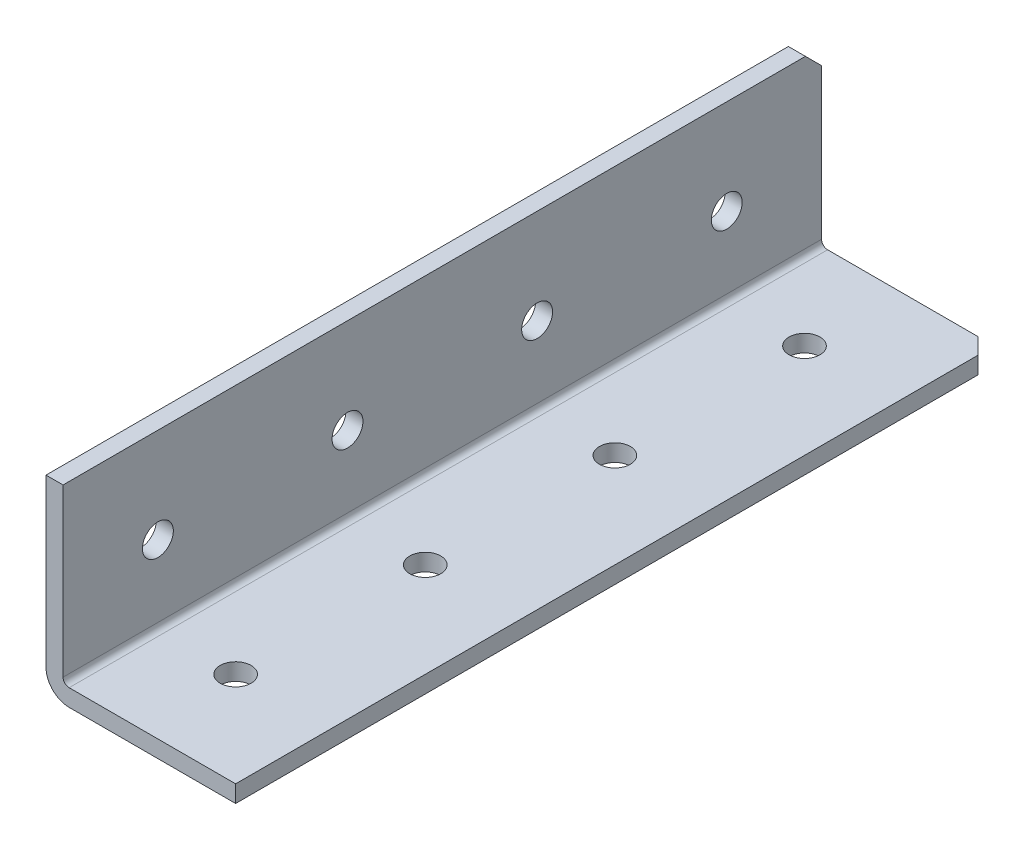
ISO-10303-21;
HEADER;
FILE_DESCRIPTION(('STEP AP214'),'2;1');
FILE_NAME('part.step','',(''),(''),'','','');
FILE_SCHEMA(('AUTOMOTIVE_DESIGN { 1 0 10303 214 1 1 1 1 }'));
ENDSEC;
DATA;
#1=APPLICATION_CONTEXT('core data for automotive mechanical design processes');
#2=APPLICATION_PROTOCOL_DEFINITION('international standard','automotive_design',2000,#1);
#3=PRODUCT_CONTEXT('',#1,'mechanical');
#4=PRODUCT('Part','Part','',(#3));
#5=PRODUCT_RELATED_PRODUCT_CATEGORY('part','',(#4));
#6=PRODUCT_DEFINITION_FORMATION('','',#4);
#7=PRODUCT_DEFINITION_CONTEXT('part definition',#1,'design');
#8=PRODUCT_DEFINITION('design','',#6,#7);
#9=PRODUCT_DEFINITION_SHAPE('','',#8);
#10=(LENGTH_UNIT() NAMED_UNIT(*) SI_UNIT(.MILLI.,.METRE.));
#11=(NAMED_UNIT(*) PLANE_ANGLE_UNIT() SI_UNIT($,.RADIAN.));
#12=(NAMED_UNIT(*) SI_UNIT($,.STERADIAN.) SOLID_ANGLE_UNIT());
#13=UNCERTAINTY_MEASURE_WITH_UNIT(LENGTH_MEASURE(1.E-05),#10,'distance_accuracy_value','');
#14=(GEOMETRIC_REPRESENTATION_CONTEXT(3) GLOBAL_UNCERTAINTY_ASSIGNED_CONTEXT((#13)) GLOBAL_UNIT_ASSIGNED_CONTEXT((#10,
#11,#12)) REPRESENTATION_CONTEXT('',''));
#15=CARTESIAN_POINT('',(0.,0.,0.));
#16=DIRECTION('',(0.,0.,1.));
#17=DIRECTION('',(1.,0.,0.));
#18=AXIS2_PLACEMENT_3D('',#15,#16,#17);
#19=CARTESIAN_POINT('',(25.4,0.,-749.3));
#20=DIRECTION('',(0.,-1.,0.));
#21=DIRECTION('',(0.,0.,-1.));
#22=AXIS2_PLACEMENT_3D('',#19,#20,#21);
#23=PLANE('',#22);
#24=DIRECTION('',(1.,0.,0.));
#25=VECTOR('',#24,1.);
#26=CARTESIAN_POINT('',(25.4,0.,-647.7));
#27=LINE('',#26,#25);
#28=CARTESIAN_POINT('',(3.0988,0.,-647.7));
#29=VERTEX_POINT('',#28);
#30=CARTESIAN_POINT('',(25.4,0.,-647.7));
#31=VERTEX_POINT('',#30);
#32=EDGE_CURVE('E110',#29,#31,#27,.T.);
#33=ORIENTED_EDGE('',*,*,#32,.F.);
#34=DIRECTION('',(0.,0.,1.));
#35=VECTOR('',#34,1.);
#36=CARTESIAN_POINT('',(3.0988,0.,-749.3));
#37=LINE('',#36,#35);
#38=CARTESIAN_POINT('',(3.0988,0.,-749.3));
#39=VERTEX_POINT('',#38);
#40=EDGE_CURVE('E56',#29,#39,#37,.F.);
#41=ORIENTED_EDGE('',*,*,#40,.T.);
#42=DIRECTION('',(-1.,0.,0.));
#43=VECTOR('',#42,1.);
#44=CARTESIAN_POINT('',(25.4,0.,-749.3));
#45=LINE('',#44,#43);
#46=CARTESIAN_POINT('',(23.2409999999998,0.,-749.3));
#47=VERTEX_POINT('',#46);
#48=EDGE_CURVE('E155',#47,#39,#45,.T.);
#49=ORIENTED_EDGE('',*,*,#48,.F.);
#50=DIRECTION('',(0.707106781186584,0.,0.707106781186511));
#51=VECTOR('',#50,1.);
#52=CARTESIAN_POINT('',(24.3205,0.,-748.2205));
#53=LINE('',#52,#51);
#54=CARTESIAN_POINT('',(25.4,0.,-747.141));
#55=VERTEX_POINT('',#54);
#56=EDGE_CURVE('E147',#47,#55,#53,.T.);
#57=ORIENTED_EDGE('',*,*,#56,.T.);
#58=DIRECTION('',(0.,0.,1.));
#59=VECTOR('',#58,1.);
#60=CARTESIAN_POINT('',(25.4,0.,-749.3));
#61=LINE('',#60,#59);
#62=EDGE_CURVE('E118',#55,#31,#61,.T.);
#63=ORIENTED_EDGE('',*,*,#62,.T.);
#64=EDGE_LOOP('',(#33,#41,#49,#57,#63));
#65=FACE_BOUND('',#64,.T.);
#66=CARTESIAN_POINT('',(12.7,0.,-736.6));
#67=DIRECTION('',(0.,-1.,0.));
#68=DIRECTION('',(0.,0.,-1.));
#69=AXIS2_PLACEMENT_3D('',#66,#67,#68);
#70=CIRCLE('',#69,2.07009999999995);
#71=CARTESIAN_POINT('',(12.7,0.,-738.6701));
#72=VERTEX_POINT('',#71);
#73=EDGE_CURVE('E160',#72,#72,#70,.T.);
#74=ORIENTED_EDGE('',*,*,#73,.F.);
#75=EDGE_LOOP('',(#74));
#76=FACE_BOUND('',#75,.T.);
#77=CARTESIAN_POINT('',(12.7,0.,-711.2));
#78=DIRECTION('',(0.,-1.,0.));
#79=DIRECTION('',(0.,0.,-1.));
#80=AXIS2_PLACEMENT_3D('',#77,#78,#79);
#81=CIRCLE('',#80,2.07009999999995);
#82=CARTESIAN_POINT('',(12.7,0.,-713.2701));
#83=VERTEX_POINT('',#82);
#84=EDGE_CURVE('E159',#83,#83,#81,.T.);
#85=ORIENTED_EDGE('',*,*,#84,.F.);
#86=EDGE_LOOP('',(#85));
#87=FACE_BOUND('',#86,.T.);
#88=CARTESIAN_POINT('',(12.7,0.,-685.8));
#89=DIRECTION('',(0.,-1.,0.));
#90=DIRECTION('',(0.,0.,-1.));
#91=AXIS2_PLACEMENT_3D('',#88,#89,#90);
#92=CIRCLE('',#91,2.07009999999995);
#93=CARTESIAN_POINT('',(12.7,0.,-687.8701));
#94=VERTEX_POINT('',#93);
#95=EDGE_CURVE('E186',#94,#94,#92,.T.);
#96=ORIENTED_EDGE('',*,*,#95,.F.);
#97=EDGE_LOOP('',(#96));
#98=FACE_BOUND('',#97,.T.);
#99=CARTESIAN_POINT('',(12.7,0.,-660.4));
#100=DIRECTION('',(0.,-1.,0.));
#101=DIRECTION('',(0.,0.,-1.));
#102=AXIS2_PLACEMENT_3D('',#99,#100,#101);
#103=CIRCLE('',#102,2.07009999999995);
#104=CARTESIAN_POINT('',(12.7,0.,-662.4701));
#105=VERTEX_POINT('',#104);
#106=EDGE_CURVE('E180',#105,#105,#103,.T.);
#107=ORIENTED_EDGE('',*,*,#106,.F.);
#108=EDGE_LOOP('',(#107));
#109=FACE_BOUND('',#108,.T.);
#110=ADVANCED_FACE('F34',(#65,#76,#87,#98,#109),#23,.T.);
#111=CARTESIAN_POINT('',(25.4,25.4,-749.3));
#112=DIRECTION('',(0.,0.,-1.));
#113=DIRECTION('',(-1.,0.,0.));
#114=AXIS2_PLACEMENT_3D('',#111,#112,#113);
#115=PLANE('',#114);
#116=ORIENTED_EDGE('',*,*,#48,.T.);
#117=CARTESIAN_POINT('',(3.0988,3.0988,-749.3));
#118=DIRECTION('',(0.,0.,-1.));
#119=DIRECTION('',(-1.,0.,0.));
#120=AXIS2_PLACEMENT_3D('',#117,#118,#119);
#121=CIRCLE('',#120,3.0988);
#122=CARTESIAN_POINT('',(0.,3.0988,-749.3));
#123=VERTEX_POINT('',#122);
#124=EDGE_CURVE('E42',#39,#123,#121,.T.);
#125=ORIENTED_EDGE('',*,*,#124,.T.);
#126=DIRECTION('',(0.,-1.,0.));
#127=VECTOR('',#126,1.);
#128=CARTESIAN_POINT('',(0.,25.4,-749.3));
#129=LINE('',#128,#127);
#130=CARTESIAN_POINT('',(0.,23.241,-749.3));
#131=VERTEX_POINT('',#130);
#132=EDGE_CURVE('E162',#131,#123,#129,.T.);
#133=ORIENTED_EDGE('',*,*,#132,.F.);
#134=DIRECTION('',(1.,0.,0.));
#135=VECTOR('',#134,1.);
#136=CARTESIAN_POINT('',(25.4,23.241,-749.3));
#137=LINE('',#136,#135);
#138=CARTESIAN_POINT('',(2.286,23.241,-749.3));
#139=VERTEX_POINT('',#138);
#140=EDGE_CURVE('E152',#131,#139,#137,.T.);
#141=ORIENTED_EDGE('',*,*,#140,.T.);
#142=DIRECTION('',(0.,1.,0.));
#143=VECTOR('',#142,1.);
#144=CARTESIAN_POINT('',(2.286,2.286,-749.3));
#145=LINE('',#144,#143);
#146=CARTESIAN_POINT('',(2.286,3.0988,-749.3));
#147=VERTEX_POINT('',#146);
#148=EDGE_CURVE('E171',#147,#139,#145,.T.);
#149=ORIENTED_EDGE('',*,*,#148,.F.);
#150=CARTESIAN_POINT('',(3.0988,3.0988,-749.3));
#151=DIRECTION('',(0.,0.,-1.));
#152=DIRECTION('',(-1.,0.,0.));
#153=AXIS2_PLACEMENT_3D('',#150,#151,#152);
#154=CIRCLE('',#153,0.8128);
#155=CARTESIAN_POINT('',(3.0988,2.286,-749.3));
#156=VERTEX_POINT('',#155);
#157=EDGE_CURVE('E125',#147,#156,#154,.F.);
#158=ORIENTED_EDGE('',*,*,#157,.T.);
#159=DIRECTION('',(-1.,0.,0.));
#160=VECTOR('',#159,1.);
#161=CARTESIAN_POINT('',(25.4,2.286,-749.3));
#162=LINE('',#161,#160);
#163=CARTESIAN_POINT('',(23.2409999999998,2.286,-749.3));
#164=VERTEX_POINT('',#163);
#165=EDGE_CURVE('E174',#164,#156,#162,.T.);
#166=ORIENTED_EDGE('',*,*,#165,.F.);
#167=DIRECTION('',(0.,-1.,0.));
#168=VECTOR('',#167,1.);
#169=CARTESIAN_POINT('',(23.2409999999998,0.,-749.3));
#170=LINE('',#169,#168);
#171=EDGE_CURVE('E149',#164,#47,#170,.T.);
#172=ORIENTED_EDGE('',*,*,#171,.T.);
#173=EDGE_LOOP('',(#116,#125,#133,#141,#149,#158,#166,#172));
#174=FACE_BOUND('',#173,.T.);
#175=ADVANCED_FACE('F247',(#174),#115,.T.);
#176=CARTESIAN_POINT('',(25.4,25.4,749.3));
#177=DIRECTION('',(0.,1.,0.));
#178=DIRECTION('',(0.,0.,1.));
#179=AXIS2_PLACEMENT_3D('',#176,#177,#178);
#180=PLANE('',#179);
#181=DIRECTION('',(-1.,0.,0.));
#182=VECTOR('',#181,1.);
#183=CARTESIAN_POINT('',(25.4,25.4,-647.7));
#184=LINE('',#183,#182);
#185=CARTESIAN_POINT('',(2.286,25.4,-647.7));
#186=VERTEX_POINT('',#185);
#187=CARTESIAN_POINT('',(0.,25.4000000000002,-647.7));
#188=VERTEX_POINT('',#187);
#189=EDGE_CURVE('E120',#186,#188,#184,.T.);
#190=ORIENTED_EDGE('',*,*,#189,.F.);
#191=DIRECTION('',(0.,0.,-1.));
#192=VECTOR('',#191,1.);
#193=CARTESIAN_POINT('',(2.286,25.4,749.3));
#194=LINE('',#193,#192);
#195=CARTESIAN_POINT('',(2.286,25.4,-747.141));
#196=VERTEX_POINT('',#195);
#197=EDGE_CURVE('E167',#186,#196,#194,.T.);
#198=ORIENTED_EDGE('',*,*,#197,.T.);
#199=DIRECTION('',(-1.,0.,0.));
#200=VECTOR('',#199,1.);
#201=CARTESIAN_POINT('',(25.4,25.4,-747.141));
#202=LINE('',#201,#200);
#203=CARTESIAN_POINT('',(0.,25.4000000000002,-747.140999999999));
#204=VERTEX_POINT('',#203);
#205=EDGE_CURVE('E139',#196,#204,#202,.T.);
#206=ORIENTED_EDGE('',*,*,#205,.T.);
#207=DIRECTION('',(0.,0.,-1.));
#208=VECTOR('',#207,1.);
#209=CARTESIAN_POINT('',(0.,25.4,749.3));
#210=LINE('',#209,#208);
#211=EDGE_CURVE('E165',#188,#204,#210,.T.);
#212=ORIENTED_EDGE('',*,*,#211,.F.);
#213=EDGE_LOOP('',(#190,#198,#206,#212));
#214=FACE_BOUND('',#213,.T.);
#215=ADVANCED_FACE('F239',(#214),#180,.T.);
#216=CARTESIAN_POINT('',(25.4,0.,0.));
#217=DIRECTION('',(-1.,0.,0.));
#218=DIRECTION('',(0.,0.,1.));
#219=AXIS2_PLACEMENT_3D('',#216,#217,#218);
#220=PLANE('',#219);
#221=DIRECTION('',(0.,0.,-1.));
#222=VECTOR('',#221,1.);
#223=CARTESIAN_POINT('',(25.4,2.286,749.3));
#224=LINE('',#223,#222);
#225=CARTESIAN_POINT('',(25.4,2.286,-647.7));
#226=VERTEX_POINT('',#225);
#227=CARTESIAN_POINT('',(25.4000000000001,2.286,-747.141));
#228=VERTEX_POINT('',#227);
#229=EDGE_CURVE('E169',#226,#228,#224,.T.);
#230=ORIENTED_EDGE('',*,*,#229,.F.);
#231=DIRECTION('',(0.,-1.,0.));
#232=VECTOR('',#231,1.);
#233=CARTESIAN_POINT('',(25.4,0.,-647.7));
#234=LINE('',#233,#232);
#235=EDGE_CURVE('E226',#226,#31,#234,.T.);
#236=ORIENTED_EDGE('',*,*,#235,.T.);
#237=ORIENTED_EDGE('',*,*,#62,.F.);
#238=DIRECTION('',(0.,1.,0.));
#239=VECTOR('',#238,1.);
#240=CARTESIAN_POINT('',(25.4,2.286,-747.141));
#241=LINE('',#240,#239);
#242=EDGE_CURVE('E144',#55,#228,#241,.T.);
#243=ORIENTED_EDGE('',*,*,#242,.T.);
#244=EDGE_LOOP('',(#230,#236,#237,#243));
#245=FACE_BOUND('',#244,.T.);
#246=ADVANCED_FACE('F255',(#245),#220,.F.);
#247=CARTESIAN_POINT('',(0.,0.,0.));
#248=DIRECTION('',(-1.,0.,0.));
#249=DIRECTION('',(0.,0.,1.));
#250=AXIS2_PLACEMENT_3D('',#247,#248,#249);
#251=PLANE('',#250);
#252=DIRECTION('',(0.,-1.,0.));
#253=VECTOR('',#252,1.);
#254=CARTESIAN_POINT('',(0.,0.,-647.7));
#255=LINE('',#254,#253);
#256=CARTESIAN_POINT('',(0.,3.0988,-647.7));
#257=VERTEX_POINT('',#256);
#258=EDGE_CURVE('E48',#188,#257,#255,.T.);
#259=ORIENTED_EDGE('',*,*,#258,.F.);
#260=ORIENTED_EDGE('',*,*,#211,.T.);
#261=DIRECTION('',(0.,0.707106781186511,0.707106781186584));
#262=VECTOR('',#261,1.);
#263=CARTESIAN_POINT('',(0.,386.270500000001,-386.270499999961));
#264=LINE('',#263,#262);
#265=EDGE_CURVE('E137',#204,#131,#264,.F.);
#266=ORIENTED_EDGE('',*,*,#265,.T.);
#267=ORIENTED_EDGE('',*,*,#132,.T.);
#268=DIRECTION('',(0.,0.,1.));
#269=VECTOR('',#268,1.);
#270=CARTESIAN_POINT('',(0.,3.0988,0.));
#271=LINE('',#270,#269);
#272=EDGE_CURVE('E123',#123,#257,#271,.T.);
#273=ORIENTED_EDGE('',*,*,#272,.T.);
#274=EDGE_LOOP('',(#259,#260,#266,#267,#273));
#275=FACE_BOUND('',#274,.T.);
#276=CARTESIAN_POINT('',(0.,12.7,-660.4));
#277=DIRECTION('',(-1.,0.,0.));
#278=DIRECTION('',(0.,0.,1.));
#279=AXIS2_PLACEMENT_3D('',#276,#277,#278);
#280=CIRCLE('',#279,2.07009999999995);
#281=CARTESIAN_POINT('',(0.,12.7,-658.3299));
#282=VERTEX_POINT('',#281);
#283=EDGE_CURVE('E217',#282,#282,#280,.T.);
#284=ORIENTED_EDGE('',*,*,#283,.F.);
#285=EDGE_LOOP('',(#284));
#286=FACE_BOUND('',#285,.T.);
#287=CARTESIAN_POINT('',(0.,12.7,-685.8));
#288=DIRECTION('',(-1.,0.,0.));
#289=DIRECTION('',(0.,0.,1.));
#290=AXIS2_PLACEMENT_3D('',#287,#288,#289);
#291=CIRCLE('',#290,2.07009999999995);
#292=CARTESIAN_POINT('',(0.,12.7,-683.7299));
#293=VERTEX_POINT('',#292);
#294=EDGE_CURVE('E211',#293,#293,#291,.T.);
#295=ORIENTED_EDGE('',*,*,#294,.F.);
#296=EDGE_LOOP('',(#295));
#297=FACE_BOUND('',#296,.T.);
#298=CARTESIAN_POINT('',(0.,12.7,-711.2));
#299=DIRECTION('',(-1.,0.,0.));
#300=DIRECTION('',(0.,0.,1.));
#301=AXIS2_PLACEMENT_3D('',#298,#299,#300);
#302=CIRCLE('',#301,2.07009999999995);
#303=CARTESIAN_POINT('',(0.,12.7,-709.1299));
#304=VERTEX_POINT('',#303);
#305=EDGE_CURVE('E205',#304,#304,#302,.T.);
#306=ORIENTED_EDGE('',*,*,#305,.F.);
#307=EDGE_LOOP('',(#306));
#308=FACE_BOUND('',#307,.T.);
#309=CARTESIAN_POINT('',(0.,12.7,-736.6));
#310=DIRECTION('',(-1.,0.,0.));
#311=DIRECTION('',(0.,0.,1.));
#312=AXIS2_PLACEMENT_3D('',#309,#310,#311);
#313=CIRCLE('',#312,2.07009999999995);
#314=CARTESIAN_POINT('',(0.,12.7,-734.5299));
#315=VERTEX_POINT('',#314);
#316=EDGE_CURVE('E199',#315,#315,#313,.T.);
#317=ORIENTED_EDGE('',*,*,#316,.F.);
#318=EDGE_LOOP('',(#317));
#319=FACE_BOUND('',#318,.T.);
#320=ADVANCED_FACE('F236',(#275,#286,#297,#308,#319),#251,.T.);
#321=CARTESIAN_POINT('',(2.286,2.286,749.3));
#322=DIRECTION('',(-1.,0.,0.));
#323=DIRECTION('',(0.,0.,1.));
#324=AXIS2_PLACEMENT_3D('',#321,#322,#323);
#325=PLANE('',#324);
#326=CARTESIAN_POINT('',(2.286,12.7,-660.4));
#327=DIRECTION('',(-1.,0.,0.));
#328=DIRECTION('',(0.,0.,1.));
#329=AXIS2_PLACEMENT_3D('',#326,#327,#328);
#330=CIRCLE('',#329,2.07009999999995);
#331=CARTESIAN_POINT('',(2.286,12.7,-658.3299));
#332=VERTEX_POINT('',#331);
#333=EDGE_CURVE('E214',#332,#332,#330,.T.);
#334=ORIENTED_EDGE('',*,*,#333,.T.);
#335=EDGE_LOOP('',(#334));
#336=FACE_BOUND('',#335,.T.);
#337=CARTESIAN_POINT('',(2.286,12.7,-685.8));
#338=DIRECTION('',(-1.,0.,0.));
#339=DIRECTION('',(0.,0.,1.));
#340=AXIS2_PLACEMENT_3D('',#337,#338,#339);
#341=CIRCLE('',#340,2.07009999999995);
#342=CARTESIAN_POINT('',(2.286,12.7,-683.7299));
#343=VERTEX_POINT('',#342);
#344=EDGE_CURVE('E208',#343,#343,#341,.T.);
#345=ORIENTED_EDGE('',*,*,#344,.T.);
#346=EDGE_LOOP('',(#345));
#347=FACE_BOUND('',#346,.T.);
#348=CARTESIAN_POINT('',(2.286,12.7,-711.2));
#349=DIRECTION('',(-1.,0.,0.));
#350=DIRECTION('',(0.,0.,1.));
#351=AXIS2_PLACEMENT_3D('',#348,#349,#350);
#352=CIRCLE('',#351,2.07009999999995);
#353=CARTESIAN_POINT('',(2.286,12.7,-709.1299));
#354=VERTEX_POINT('',#353);
#355=EDGE_CURVE('E202',#354,#354,#352,.T.);
#356=ORIENTED_EDGE('',*,*,#355,.T.);
#357=EDGE_LOOP('',(#356));
#358=FACE_BOUND('',#357,.T.);
#359=CARTESIAN_POINT('',(2.286,12.7,-736.6));
#360=DIRECTION('',(-1.,0.,0.));
#361=DIRECTION('',(0.,0.,1.));
#362=AXIS2_PLACEMENT_3D('',#359,#360,#361);
#363=CIRCLE('',#362,2.07009999999995);
#364=CARTESIAN_POINT('',(2.286,12.7,-734.5299));
#365=VERTEX_POINT('',#364);
#366=EDGE_CURVE('E196',#365,#365,#363,.T.);
#367=ORIENTED_EDGE('',*,*,#366,.T.);
#368=EDGE_LOOP('',(#367));
#369=FACE_BOUND('',#368,.T.);
#370=ORIENTED_EDGE('',*,*,#197,.F.);
#371=DIRECTION('',(0.,-1.,0.));
#372=VECTOR('',#371,1.);
#373=CARTESIAN_POINT('',(2.286,2.286,-647.7));
#374=LINE('',#373,#372);
#375=CARTESIAN_POINT('',(2.286,3.0988,-647.7));
#376=VERTEX_POINT('',#375);
#377=EDGE_CURVE('E119',#186,#376,#374,.T.);
#378=ORIENTED_EDGE('',*,*,#377,.T.);
#379=DIRECTION('',(0.,0.,-1.));
#380=VECTOR('',#379,1.);
#381=CARTESIAN_POINT('',(2.286,3.0988,-749.3));
#382=LINE('',#381,#380);
#383=EDGE_CURVE('E132',#376,#147,#382,.T.);
#384=ORIENTED_EDGE('',*,*,#383,.T.);
#385=ORIENTED_EDGE('',*,*,#148,.T.);
#386=DIRECTION('',(0.,-0.707106781186511,-0.707106781186584));
#387=VECTOR('',#386,1.);
#388=CARTESIAN_POINT('',(2.286,25.4,-747.141));
#389=LINE('',#388,#387);
#390=EDGE_CURVE('E134',#139,#196,#389,.F.);
#391=ORIENTED_EDGE('',*,*,#390,.T.);
#392=EDGE_LOOP('',(#370,#378,#384,#385,#391));
#393=FACE_BOUND('',#392,.T.);
#394=ADVANCED_FACE('F266',(#336,#347,#358,#369,#393),#325,.F.);
#395=CARTESIAN_POINT('',(25.4,2.286,749.3));
#396=DIRECTION('',(0.,-1.,0.));
#397=DIRECTION('',(0.,0.,-1.));
#398=AXIS2_PLACEMENT_3D('',#395,#396,#397);
#399=PLANE('',#398);
#400=CARTESIAN_POINT('',(12.7,2.286,-736.6));
#401=DIRECTION('',(0.,-1.,0.));
#402=DIRECTION('',(0.,0.,-1.));
#403=AXIS2_PLACEMENT_3D('',#400,#401,#402);
#404=CIRCLE('',#403,2.07009999999995);
#405=CARTESIAN_POINT('',(12.7,2.286,-738.6701));
#406=VERTEX_POINT('',#405);
#407=EDGE_CURVE('E156',#406,#406,#404,.T.);
#408=ORIENTED_EDGE('',*,*,#407,.T.);
#409=EDGE_LOOP('',(#408));
#410=FACE_BOUND('',#409,.T.);
#411=CARTESIAN_POINT('',(12.7,2.286,-711.2));
#412=DIRECTION('',(0.,-1.,0.));
#413=DIRECTION('',(0.,0.,-1.));
#414=AXIS2_PLACEMENT_3D('',#411,#412,#413);
#415=CIRCLE('',#414,2.07009999999995);
#416=CARTESIAN_POINT('',(12.7,2.286,-713.2701));
#417=VERTEX_POINT('',#416);
#418=EDGE_CURVE('E189',#417,#417,#415,.T.);
#419=ORIENTED_EDGE('',*,*,#418,.T.);
#420=EDGE_LOOP('',(#419));
#421=FACE_BOUND('',#420,.T.);
#422=CARTESIAN_POINT('',(12.7,2.286,-685.8));
#423=DIRECTION('',(0.,-1.,0.));
#424=DIRECTION('',(0.,0.,-1.));
#425=AXIS2_PLACEMENT_3D('',#422,#423,#424);
#426=CIRCLE('',#425,2.07009999999995);
#427=CARTESIAN_POINT('',(12.7,2.286,-687.8701));
#428=VERTEX_POINT('',#427);
#429=EDGE_CURVE('E183',#428,#428,#426,.T.);
#430=ORIENTED_EDGE('',*,*,#429,.T.);
#431=EDGE_LOOP('',(#430));
#432=FACE_BOUND('',#431,.T.);
#433=CARTESIAN_POINT('',(12.7,2.286,-660.4));
#434=DIRECTION('',(0.,-1.,0.));
#435=DIRECTION('',(0.,0.,-1.));
#436=AXIS2_PLACEMENT_3D('',#433,#434,#435);
#437=CIRCLE('',#436,2.07009999999995);
#438=CARTESIAN_POINT('',(12.7,2.286,-662.4701));
#439=VERTEX_POINT('',#438);
#440=EDGE_CURVE('E177',#439,#439,#437,.T.);
#441=ORIENTED_EDGE('',*,*,#440,.T.);
#442=EDGE_LOOP('',(#441));
#443=FACE_BOUND('',#442,.T.);
#444=DIRECTION('',(0.,0.,-1.));
#445=VECTOR('',#444,1.);
#446=CARTESIAN_POINT('',(3.0988,2.286,749.3));
#447=LINE('',#446,#445);
#448=CARTESIAN_POINT('',(3.0988,2.286,-647.7));
#449=VERTEX_POINT('',#448);
#450=EDGE_CURVE('E129',#156,#449,#447,.F.);
#451=ORIENTED_EDGE('',*,*,#450,.T.);
#452=DIRECTION('',(1.,0.,0.));
#453=VECTOR('',#452,1.);
#454=CARTESIAN_POINT('',(25.4,2.286,-647.7));
#455=LINE('',#454,#453);
#456=EDGE_CURVE('E220',#449,#226,#455,.T.);
#457=ORIENTED_EDGE('',*,*,#456,.T.);
#458=ORIENTED_EDGE('',*,*,#229,.T.);
#459=DIRECTION('',(-0.707106781186584,0.,-0.707106781186511));
#460=VECTOR('',#459,1.);
#461=CARTESIAN_POINT('',(23.2409999999998,2.286,-749.3));
#462=LINE('',#461,#460);
#463=EDGE_CURVE('E142',#228,#164,#462,.T.);
#464=ORIENTED_EDGE('',*,*,#463,.T.);
#465=ORIENTED_EDGE('',*,*,#165,.T.);
#466=EDGE_LOOP('',(#451,#457,#458,#464,#465));
#467=FACE_BOUND('',#466,.T.);
#468=ADVANCED_FACE('F259',(#410,#421,#432,#443,#467),#399,.F.);
#469=CARTESIAN_POINT('',(12.7,0.,-660.4));
#470=DIRECTION('',(0.,-1.,0.));
#471=DIRECTION('',(0.,0.,-1.));
#472=AXIS2_PLACEMENT_3D('',#469,#470,#471);
#473=CYLINDRICAL_SURFACE('',#472,2.07009999999995);
#474=ORIENTED_EDGE('',*,*,#106,.T.);
#475=EDGE_LOOP('',(#474));
#476=FACE_BOUND('',#475,.T.);
#477=ORIENTED_EDGE('',*,*,#440,.F.);
#478=EDGE_LOOP('',(#477));
#479=FACE_BOUND('',#478,.T.);
#480=ADVANCED_FACE('F274',(#476,#479),#473,.F.);
#481=CARTESIAN_POINT('',(12.7,0.,-685.8));
#482=DIRECTION('',(0.,-1.,0.));
#483=DIRECTION('',(0.,0.,-1.));
#484=AXIS2_PLACEMENT_3D('',#481,#482,#483);
#485=CYLINDRICAL_SURFACE('',#484,2.07009999999995);
#486=ORIENTED_EDGE('',*,*,#95,.T.);
#487=EDGE_LOOP('',(#486));
#488=FACE_BOUND('',#487,.T.);
#489=ORIENTED_EDGE('',*,*,#429,.F.);
#490=EDGE_LOOP('',(#489));
#491=FACE_BOUND('',#490,.T.);
#492=ADVANCED_FACE('F327',(#488,#491),#485,.F.);
#493=CARTESIAN_POINT('',(12.7,0.,-711.2));
#494=DIRECTION('',(0.,-1.,0.));
#495=DIRECTION('',(0.,0.,-1.));
#496=AXIS2_PLACEMENT_3D('',#493,#494,#495);
#497=CYLINDRICAL_SURFACE('',#496,2.07009999999995);
#498=ORIENTED_EDGE('',*,*,#84,.T.);
#499=EDGE_LOOP('',(#498));
#500=FACE_BOUND('',#499,.T.);
#501=ORIENTED_EDGE('',*,*,#418,.F.);
#502=EDGE_LOOP('',(#501));
#503=FACE_BOUND('',#502,.T.);
#504=ADVANCED_FACE('F323',(#500,#503),#497,.F.);
#505=CARTESIAN_POINT('',(12.7,0.,-736.6));
#506=DIRECTION('',(0.,-1.,0.));
#507=DIRECTION('',(0.,0.,-1.));
#508=AXIS2_PLACEMENT_3D('',#505,#506,#507);
#509=CYLINDRICAL_SURFACE('',#508,2.07009999999995);
#510=ORIENTED_EDGE('',*,*,#73,.T.);
#511=EDGE_LOOP('',(#510));
#512=FACE_BOUND('',#511,.T.);
#513=ORIENTED_EDGE('',*,*,#407,.F.);
#514=EDGE_LOOP('',(#513));
#515=FACE_BOUND('',#514,.T.);
#516=ADVANCED_FACE('F319',(#512,#515),#509,.F.);
#517=CARTESIAN_POINT('',(0.,12.7,-736.6));
#518=DIRECTION('',(-1.,0.,0.));
#519=DIRECTION('',(0.,0.,1.));
#520=AXIS2_PLACEMENT_3D('',#517,#518,#519);
#521=CYLINDRICAL_SURFACE('',#520,2.07009999999995);
#522=ORIENTED_EDGE('',*,*,#316,.T.);
#523=EDGE_LOOP('',(#522));
#524=FACE_BOUND('',#523,.T.);
#525=ORIENTED_EDGE('',*,*,#366,.F.);
#526=EDGE_LOOP('',(#525));
#527=FACE_BOUND('',#526,.T.);
#528=ADVANCED_FACE('F315',(#524,#527),#521,.F.);
#529=CARTESIAN_POINT('',(0.,12.7,-711.2));
#530=DIRECTION('',(-1.,0.,0.));
#531=DIRECTION('',(0.,0.,1.));
#532=AXIS2_PLACEMENT_3D('',#529,#530,#531);
#533=CYLINDRICAL_SURFACE('',#532,2.07009999999995);
#534=ORIENTED_EDGE('',*,*,#305,.T.);
#535=EDGE_LOOP('',(#534));
#536=FACE_BOUND('',#535,.T.);
#537=ORIENTED_EDGE('',*,*,#355,.F.);
#538=EDGE_LOOP('',(#537));
#539=FACE_BOUND('',#538,.T.);
#540=ADVANCED_FACE('F311',(#536,#539),#533,.F.);
#541=CARTESIAN_POINT('',(0.,12.7,-685.8));
#542=DIRECTION('',(-1.,0.,0.));
#543=DIRECTION('',(0.,0.,1.));
#544=AXIS2_PLACEMENT_3D('',#541,#542,#543);
#545=CYLINDRICAL_SURFACE('',#544,2.07009999999995);
#546=ORIENTED_EDGE('',*,*,#294,.T.);
#547=EDGE_LOOP('',(#546));
#548=FACE_BOUND('',#547,.T.);
#549=ORIENTED_EDGE('',*,*,#344,.F.);
#550=EDGE_LOOP('',(#549));
#551=FACE_BOUND('',#550,.T.);
#552=ADVANCED_FACE('F307',(#548,#551),#545,.F.);
#553=CARTESIAN_POINT('',(0.,12.7,-660.4));
#554=DIRECTION('',(-1.,0.,0.));
#555=DIRECTION('',(0.,0.,1.));
#556=AXIS2_PLACEMENT_3D('',#553,#554,#555);
#557=CYLINDRICAL_SURFACE('',#556,2.07009999999995);
#558=ORIENTED_EDGE('',*,*,#283,.T.);
#559=EDGE_LOOP('',(#558));
#560=FACE_BOUND('',#559,.T.);
#561=ORIENTED_EDGE('',*,*,#333,.F.);
#562=EDGE_LOOP('',(#561));
#563=FACE_BOUND('',#562,.T.);
#564=ADVANCED_FACE('F292',(#560,#563),#557,.F.);
#565=CARTESIAN_POINT('',(23.2409999999998,25.4,-749.3));
#566=DIRECTION('',(0.707106781186511,0.,-0.707106781186584));
#567=DIRECTION('',(0.,1.,0.));
#568=AXIS2_PLACEMENT_3D('',#565,#566,#567);
#569=PLANE('',#568);
#570=ORIENTED_EDGE('',*,*,#463,.F.);
#571=ORIENTED_EDGE('',*,*,#242,.F.);
#572=ORIENTED_EDGE('',*,*,#56,.F.);
#573=ORIENTED_EDGE('',*,*,#171,.F.);
#574=EDGE_LOOP('',(#570,#571,#572,#573));
#575=FACE_BOUND('',#574,.T.);
#576=ADVANCED_FACE('F257',(#575),#569,.T.);
#577=CARTESIAN_POINT('',(25.4,25.4,-747.141));
#578=DIRECTION('',(0.,-0.707106781186584,0.707106781186511));
#579=DIRECTION('',(-1.,0.,0.));
#580=AXIS2_PLACEMENT_3D('',#577,#578,#579);
#581=PLANE('',#580);
#582=ORIENTED_EDGE('',*,*,#390,.F.);
#583=ORIENTED_EDGE('',*,*,#140,.F.);
#584=ORIENTED_EDGE('',*,*,#265,.F.);
#585=ORIENTED_EDGE('',*,*,#205,.F.);
#586=EDGE_LOOP('',(#582,#583,#584,#585));
#587=FACE_BOUND('',#586,.T.);
#588=ADVANCED_FACE('F243',(#587),#581,.F.);
#589=CARTESIAN_POINT('',(3.0988,3.0988,749.3));
#590=DIRECTION('',(0.,0.,1.));
#591=DIRECTION('',(1.,0.,0.));
#592=AXIS2_PLACEMENT_3D('',#589,#590,#591);
#593=CYLINDRICAL_SURFACE('',#592,0.8128);
#594=ORIENTED_EDGE('',*,*,#383,.F.);
#595=CARTESIAN_POINT('',(3.0988,3.0988,-647.7));
#596=DIRECTION('',(0.,0.,-1.));
#597=DIRECTION('',(-1.,0.,0.));
#598=AXIS2_PLACEMENT_3D('',#595,#596,#597);
#599=CIRCLE('',#598,0.8128);
#600=EDGE_CURVE('E223',#376,#449,#599,.F.);
#601=ORIENTED_EDGE('',*,*,#600,.T.);
#602=ORIENTED_EDGE('',*,*,#450,.F.);
#603=ORIENTED_EDGE('',*,*,#157,.F.);
#604=EDGE_LOOP('',(#594,#601,#602,#603));
#605=FACE_BOUND('',#604,.T.);
#606=ADVANCED_FACE('F264',(#605),#593,.F.);
#607=CARTESIAN_POINT('',(3.0988,3.0988,0.));
#608=DIRECTION('',(0.,0.,1.));
#609=DIRECTION('',(1.,0.,0.));
#610=AXIS2_PLACEMENT_3D('',#607,#608,#609);
#611=CYLINDRICAL_SURFACE('',#610,3.0988);
#612=CARTESIAN_POINT('',(3.0988,3.0988,-647.7));
#613=DIRECTION('',(0.,0.,-1.));
#614=DIRECTION('',(-1.,0.,0.));
#615=AXIS2_PLACEMENT_3D('',#612,#613,#614);
#616=CIRCLE('',#615,3.0988);
#617=EDGE_CURVE('E11',#257,#29,#616,.F.);
#618=ORIENTED_EDGE('',*,*,#617,.F.);
#619=ORIENTED_EDGE('',*,*,#272,.F.);
#620=ORIENTED_EDGE('',*,*,#124,.F.);
#621=ORIENTED_EDGE('',*,*,#40,.F.);
#622=EDGE_LOOP('',(#618,#619,#620,#621));
#623=FACE_BOUND('',#622,.T.);
#624=ADVANCED_FACE('F36',(#623),#611,.T.);
#625=CARTESIAN_POINT('',(0.,0.,-647.7));
#626=DIRECTION('',(0.,0.,-1.));
#627=DIRECTION('',(-1.,0.,0.));
#628=AXIS2_PLACEMENT_3D('',#625,#626,#627);
#629=PLANE('',#628);
#630=ORIENTED_EDGE('',*,*,#600,.F.);
#631=ORIENTED_EDGE('',*,*,#377,.F.);
#632=ORIENTED_EDGE('',*,*,#189,.T.);
#633=ORIENTED_EDGE('',*,*,#258,.T.);
#634=ORIENTED_EDGE('',*,*,#617,.T.);
#635=ORIENTED_EDGE('',*,*,#32,.T.);
#636=ORIENTED_EDGE('',*,*,#235,.F.);
#637=ORIENTED_EDGE('',*,*,#456,.F.);
#638=EDGE_LOOP('',(#630,#631,#632,#633,#634,#635,#636,#637));
#639=FACE_BOUND('',#638,.T.);
#640=ADVANCED_FACE('F109',(#639),#629,.F.);
#641=CLOSED_SHELL('',(#110,#175,#215,#246,#320,#394,#468,#480,#492,#504,#516,#528,#540,#552,
#564,#576,#588,#606,#624,#640));
#642=MANIFOLD_SOLID_BREP('B2',#641);
#643=ADVANCED_BREP_SHAPE_REPRESENTATION('',(#18,#642),#14);
#644=SHAPE_DEFINITION_REPRESENTATION(#9,#643);
ENDSEC;
END-ISO-10303-21;
